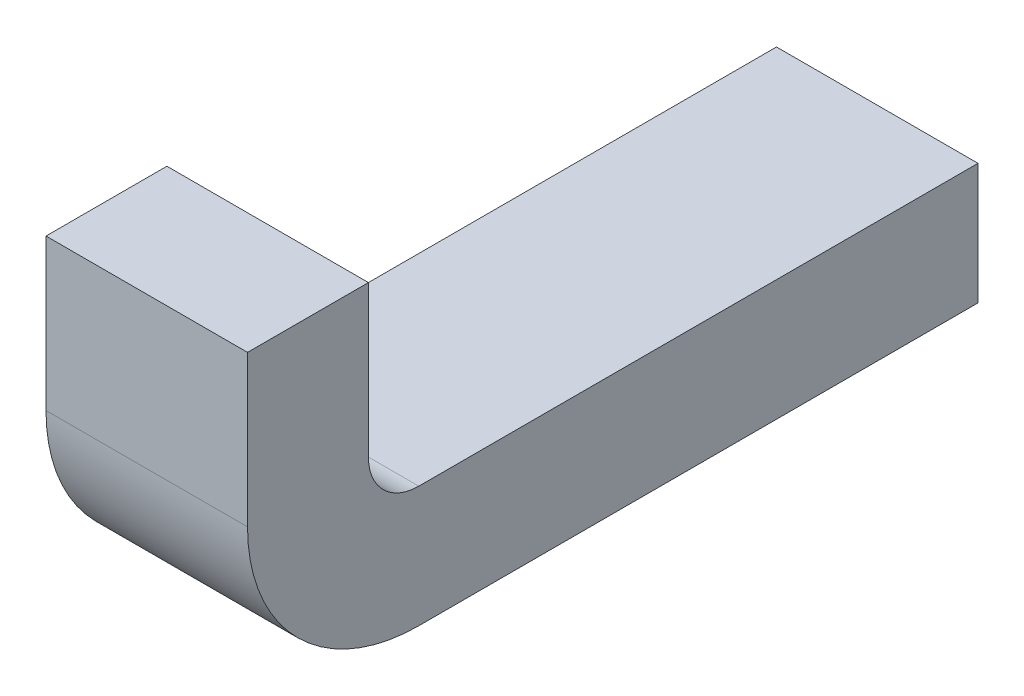
ISO-10303-21;
HEADER;
FILE_DESCRIPTION(('STEP AP214'),'2;1');
FILE_NAME('part.step','',(''),(''),'','','');
FILE_SCHEMA(('AUTOMOTIVE_DESIGN { 1 0 10303 214 1 1 1 1 }'));
ENDSEC;
DATA;
#1=APPLICATION_CONTEXT('core data for automotive mechanical design processes');
#2=APPLICATION_PROTOCOL_DEFINITION('international standard','automotive_design',2000,#1);
#3=PRODUCT_CONTEXT('',#1,'mechanical');
#4=PRODUCT('Part','Part','',(#3));
#5=PRODUCT_RELATED_PRODUCT_CATEGORY('part','',(#4));
#6=PRODUCT_DEFINITION_FORMATION('','',#4);
#7=PRODUCT_DEFINITION_CONTEXT('part definition',#1,'design');
#8=PRODUCT_DEFINITION('design','',#6,#7);
#9=PRODUCT_DEFINITION_SHAPE('','',#8);
#10=(LENGTH_UNIT() NAMED_UNIT(*) SI_UNIT(.MILLI.,.METRE.));
#11=(NAMED_UNIT(*) PLANE_ANGLE_UNIT() SI_UNIT($,.RADIAN.));
#12=(NAMED_UNIT(*) SI_UNIT($,.STERADIAN.) SOLID_ANGLE_UNIT());
#13=UNCERTAINTY_MEASURE_WITH_UNIT(LENGTH_MEASURE(1.E-05),#10,'distance_accuracy_value','');
#14=(GEOMETRIC_REPRESENTATION_CONTEXT(3) GLOBAL_UNCERTAINTY_ASSIGNED_CONTEXT((#13)) GLOBAL_UNIT_ASSIGNED_CONTEXT((#10,
#11,#12)) REPRESENTATION_CONTEXT('',''));
#15=CARTESIAN_POINT('',(0.,0.,0.));
#16=DIRECTION('',(0.,0.,1.));
#17=DIRECTION('',(1.,0.,0.));
#18=AXIS2_PLACEMENT_3D('',#15,#16,#17);
#19=CARTESIAN_POINT('',(0.15,0.,-3.300000000002));
#20=DIRECTION('',(0.,-1.,0.));
#21=DIRECTION('',(1.,0.,0.));
#22=AXIS2_PLACEMENT_3D('',#19,#20,#21);
#23=PLANE('',#22);
#24=DIRECTION('',(0.,0.,1.));
#25=VECTOR('',#24,1.);
#26=CARTESIAN_POINT('',(0.15,0.,-3.300000000002));
#27=LINE('',#26,#25);
#28=CARTESIAN_POINT('',(0.15,0.,-3.300000000002));
#29=VERTEX_POINT('',#28);
#30=CARTESIAN_POINT('',(0.15,0.,-3.854999999999));
#31=VERTEX_POINT('',#30);
#32=EDGE_CURVE('E121',#29,#31,#27,.F.);
#33=ORIENTED_EDGE('',*,*,#32,.T.);
#34=DIRECTION('',(-1.,0.,0.));
#35=VECTOR('',#34,1.);
#36=CARTESIAN_POINT('',(0.15,0.,-3.854999999999));
#37=LINE('',#36,#35);
#38=CARTESIAN_POINT('',(0.35,0.,-3.854999999999));
#39=VERTEX_POINT('',#38);
#40=EDGE_CURVE('E124',#39,#31,#37,.T.);
#41=ORIENTED_EDGE('',*,*,#40,.F.);
#42=DIRECTION('',(0.,0.,1.));
#43=VECTOR('',#42,1.);
#44=CARTESIAN_POINT('',(0.35,0.,-3.300000000002));
#45=LINE('',#44,#43);
#46=CARTESIAN_POINT('',(0.35,0.,-3.300000000002));
#47=VERTEX_POINT('',#46);
#48=EDGE_CURVE('E154',#47,#39,#45,.F.);
#49=ORIENTED_EDGE('',*,*,#48,.F.);
#50=DIRECTION('',(1.,0.,0.));
#51=VECTOR('',#50,1.);
#52=CARTESIAN_POINT('',(0.15,0.,-3.300000000002));
#53=LINE('',#52,#51);
#54=EDGE_CURVE('E63',#29,#47,#53,.T.);
#55=ORIENTED_EDGE('',*,*,#54,.F.);
#56=EDGE_LOOP('',(#33,#41,#49,#55));
#57=FACE_BOUND('',#56,.T.);
#58=ADVANCED_FACE('F16',(#57),#23,.T.);
#59=CARTESIAN_POINT('',(0.15,0.32,-3.250000000002));
#60=DIRECTION('',(0.,1.,1.246832498358E-13));
#61=DIRECTION('',(0.,-1.246832498358E-13,1.));
#62=AXIS2_PLACEMENT_3D('',#59,#60,#61);
#63=PLANE('',#62);
#64=DIRECTION('',(0.,0.,1.));
#65=VECTOR('',#64,1.);
#66=CARTESIAN_POINT('',(0.15,0.32,-3.300000000002));
#67=LINE('',#66,#65);
#68=CARTESIAN_POINT('',(0.15,0.32,-3.250000000002));
#69=VERTEX_POINT('',#68);
#70=CARTESIAN_POINT('',(0.15,0.32,-3.130000000002));
#71=VERTEX_POINT('',#70);
#72=EDGE_CURVE('E100',#69,#71,#67,.T.);
#73=ORIENTED_EDGE('',*,*,#72,.T.);
#74=DIRECTION('',(1.,0.,0.));
#75=VECTOR('',#74,1.);
#76=CARTESIAN_POINT('',(0.15,0.32,-3.130000000002));
#77=LINE('',#76,#75);
#78=CARTESIAN_POINT('',(0.35,0.32,-3.130000000002));
#79=VERTEX_POINT('',#78);
#80=EDGE_CURVE('E162',#79,#71,#77,.F.);
#81=ORIENTED_EDGE('',*,*,#80,.F.);
#82=DIRECTION('',(0.,0.,1.));
#83=VECTOR('',#82,1.);
#84=CARTESIAN_POINT('',(0.35,0.32,-3.300000000002));
#85=LINE('',#84,#83);
#86=CARTESIAN_POINT('',(0.35,0.32,-3.250000000002));
#87=VERTEX_POINT('',#86);
#88=EDGE_CURVE('E150',#87,#79,#85,.T.);
#89=ORIENTED_EDGE('',*,*,#88,.F.);
#90=DIRECTION('',(-1.,0.,0.));
#91=VECTOR('',#90,1.);
#92=CARTESIAN_POINT('',(0.15,0.32,-3.250000000002));
#93=LINE('',#92,#91);
#94=EDGE_CURVE('E72',#69,#87,#93,.F.);
#95=ORIENTED_EDGE('',*,*,#94,.F.);
#96=EDGE_LOOP('',(#73,#81,#89,#95));
#97=FACE_BOUND('',#96,.T.);
#98=ADVANCED_FACE('F182',(#97),#63,.T.);
#99=CARTESIAN_POINT('',(0.15,0.32,-3.130000000002));
#100=DIRECTION('',(0.,0.,1.));
#101=DIRECTION('',(1.,0.,0.));
#102=AXIS2_PLACEMENT_3D('',#99,#100,#101);
#103=PLANE('',#102);
#104=DIRECTION('',(0.,1.,0.));
#105=VECTOR('',#104,1.);
#106=CARTESIAN_POINT('',(0.15,0.17,-3.130000000002));
#107=LINE('',#106,#105);
#108=CARTESIAN_POINT('',(0.15,0.17,-3.130000000002));
#109=VERTEX_POINT('',#108);
#110=EDGE_CURVE('E110',#71,#109,#107,.F.);
#111=ORIENTED_EDGE('',*,*,#110,.T.);
#112=DIRECTION('',(1.,0.,0.));
#113=VECTOR('',#112,1.);
#114=CARTESIAN_POINT('',(0.15,0.17,-3.130000000002));
#115=LINE('',#114,#113);
#116=CARTESIAN_POINT('',(0.35,0.17,-3.130000000002));
#117=VERTEX_POINT('',#116);
#118=EDGE_CURVE('E57',#117,#109,#115,.F.);
#119=ORIENTED_EDGE('',*,*,#118,.F.);
#120=DIRECTION('',(0.,1.,0.));
#121=VECTOR('',#120,1.);
#122=CARTESIAN_POINT('',(0.35,0.17,-3.130000000002));
#123=LINE('',#122,#121);
#124=EDGE_CURVE('E141',#79,#117,#123,.F.);
#125=ORIENTED_EDGE('',*,*,#124,.F.);
#126=ORIENTED_EDGE('',*,*,#80,.T.);
#127=EDGE_LOOP('',(#111,#119,#125,#126));
#128=FACE_BOUND('',#127,.T.);
#129=ADVANCED_FACE('F183',(#128),#103,.T.);
#130=CARTESIAN_POINT('',(0.15,0.17,-3.300000000002));
#131=DIRECTION('',(1.,0.,0.));
#132=DIRECTION('',(0.,1.,0.));
#133=AXIS2_PLACEMENT_3D('',#130,#131,#132);
#134=CYLINDRICAL_SURFACE('',#133,0.17);
#135=CARTESIAN_POINT('',(0.15,0.17,-3.300000000002));
#136=DIRECTION('',(1.,0.,0.));
#137=DIRECTION('',(0.,1.,0.));
#138=AXIS2_PLACEMENT_3D('',#135,#136,#137);
#139=CIRCLE('',#138,0.17);
#140=EDGE_CURVE('E96',#109,#29,#139,.T.);
#141=ORIENTED_EDGE('',*,*,#140,.T.);
#142=ORIENTED_EDGE('',*,*,#54,.T.);
#143=CARTESIAN_POINT('',(0.35,0.17,-3.300000000002));
#144=DIRECTION('',(1.,0.,0.));
#145=DIRECTION('',(0.,1.,0.));
#146=AXIS2_PLACEMENT_3D('',#143,#144,#145);
#147=CIRCLE('',#146,0.17);
#148=EDGE_CURVE('E19',#117,#47,#147,.T.);
#149=ORIENTED_EDGE('',*,*,#148,.F.);
#150=ORIENTED_EDGE('',*,*,#118,.T.);
#151=EDGE_LOOP('',(#141,#142,#149,#150));
#152=FACE_BOUND('',#151,.T.);
#153=ADVANCED_FACE('F185',(#152),#134,.T.);
#154=CARTESIAN_POINT('',(0.15,0.17,-3.250000000002));
#155=DIRECTION('',(0.,0.,-1.));
#156=DIRECTION('',(-1.,0.,0.));
#157=AXIS2_PLACEMENT_3D('',#154,#155,#156);
#158=PLANE('',#157);
#159=DIRECTION('',(0.,1.,0.));
#160=VECTOR('',#159,1.);
#161=CARTESIAN_POINT('',(0.15,0.17,-3.250000000002));
#162=LINE('',#161,#160);
#163=CARTESIAN_POINT('',(0.15,0.17,-3.250000000002));
#164=VERTEX_POINT('',#163);
#165=EDGE_CURVE('E92',#164,#69,#162,.T.);
#166=ORIENTED_EDGE('',*,*,#165,.T.);
#167=ORIENTED_EDGE('',*,*,#94,.T.);
#168=DIRECTION('',(0.,1.,0.));
#169=VECTOR('',#168,1.);
#170=CARTESIAN_POINT('',(0.35,0.17,-3.250000000002));
#171=LINE('',#170,#169);
#172=CARTESIAN_POINT('',(0.35,0.17,-3.250000000002));
#173=VERTEX_POINT('',#172);
#174=EDGE_CURVE('E87',#173,#87,#171,.T.);
#175=ORIENTED_EDGE('',*,*,#174,.F.);
#176=DIRECTION('',(1.,0.,0.));
#177=VECTOR('',#176,1.);
#178=CARTESIAN_POINT('',(0.15,0.17,-3.250000000002));
#179=LINE('',#178,#177);
#180=EDGE_CURVE('E90',#173,#164,#179,.F.);
#181=ORIENTED_EDGE('',*,*,#180,.T.);
#182=EDGE_LOOP('',(#166,#167,#175,#181));
#183=FACE_BOUND('',#182,.T.);
#184=ADVANCED_FACE('F91',(#183),#158,.T.);
#185=CARTESIAN_POINT('',(0.35,0.17,-3.300000000002));
#186=DIRECTION('',(1.,0.,0.));
#187=DIRECTION('',(0.,1.,0.));
#188=AXIS2_PLACEMENT_3D('',#185,#186,#187);
#189=PLANE('',#188);
#190=ORIENTED_EDGE('',*,*,#88,.T.);
#191=ORIENTED_EDGE('',*,*,#124,.T.);
#192=ORIENTED_EDGE('',*,*,#148,.T.);
#193=ORIENTED_EDGE('',*,*,#48,.T.);
#194=DIRECTION('',(0.,1.,0.));
#195=VECTOR('',#194,1.);
#196=CARTESIAN_POINT('',(0.35,0.,-3.854999999999));
#197=LINE('',#196,#195);
#198=CARTESIAN_POINT('',(0.35,0.12,-3.854999999999));
#199=VERTEX_POINT('',#198);
#200=EDGE_CURVE('E138',#199,#39,#197,.F.);
#201=ORIENTED_EDGE('',*,*,#200,.F.);
#202=DIRECTION('',(0.,0.,1.));
#203=VECTOR('',#202,1.);
#204=CARTESIAN_POINT('',(0.35,0.12,-3.854999999999));
#205=LINE('',#204,#203);
#206=CARTESIAN_POINT('',(0.35,0.119999999999999,-3.300000000002));
#207=VERTEX_POINT('',#206);
#208=EDGE_CURVE('E107',#207,#199,#205,.F.);
#209=ORIENTED_EDGE('',*,*,#208,.F.);
#210=CARTESIAN_POINT('',(0.35,0.17,-3.300000000002));
#211=DIRECTION('',(1.,0.,0.));
#212=DIRECTION('',(0.,1.,0.));
#213=AXIS2_PLACEMENT_3D('',#210,#211,#212);
#214=CIRCLE('',#213,0.05);
#215=EDGE_CURVE('E105',#207,#173,#214,.F.);
#216=ORIENTED_EDGE('',*,*,#215,.T.);
#217=ORIENTED_EDGE('',*,*,#174,.T.);
#218=EDGE_LOOP('',(#190,#191,#192,#193,#201,#209,#216,#217));
#219=FACE_BOUND('',#218,.T.);
#220=ADVANCED_FACE('F179',(#219),#189,.T.);
#221=CARTESIAN_POINT('',(0.15,0.,-3.854999999999));
#222=DIRECTION('',(0.,0.,-1.));
#223=DIRECTION('',(-1.,0.,0.));
#224=AXIS2_PLACEMENT_3D('',#221,#222,#223);
#225=PLANE('',#224);
#226=DIRECTION('',(0.,1.,0.));
#227=VECTOR('',#226,1.);
#228=CARTESIAN_POINT('',(0.15,0.17,-3.854999999999));
#229=LINE('',#228,#227);
#230=CARTESIAN_POINT('',(0.15,0.12,-3.854999999999));
#231=VERTEX_POINT('',#230);
#232=EDGE_CURVE('E101',#31,#231,#229,.T.);
#233=ORIENTED_EDGE('',*,*,#232,.T.);
#234=DIRECTION('',(-1.,0.,0.));
#235=VECTOR('',#234,1.);
#236=CARTESIAN_POINT('',(0.15,0.12,-3.854999999999));
#237=LINE('',#236,#235);
#238=EDGE_CURVE('E128',#199,#231,#237,.T.);
#239=ORIENTED_EDGE('',*,*,#238,.F.);
#240=ORIENTED_EDGE('',*,*,#200,.T.);
#241=ORIENTED_EDGE('',*,*,#40,.T.);
#242=EDGE_LOOP('',(#233,#239,#240,#241));
#243=FACE_BOUND('',#242,.T.);
#244=ADVANCED_FACE('F204',(#243),#225,.T.);
#245=CARTESIAN_POINT('',(0.15,0.17,-3.300000000002));
#246=DIRECTION('',(1.,0.,0.));
#247=DIRECTION('',(0.,1.,0.));
#248=AXIS2_PLACEMENT_3D('',#245,#246,#247);
#249=PLANE('',#248);
#250=ORIENTED_EDGE('',*,*,#110,.F.);
#251=ORIENTED_EDGE('',*,*,#72,.F.);
#252=ORIENTED_EDGE('',*,*,#165,.F.);
#253=CARTESIAN_POINT('',(0.15,0.17,-3.300000000002));
#254=DIRECTION('',(1.,0.,0.));
#255=DIRECTION('',(0.,1.,0.));
#256=AXIS2_PLACEMENT_3D('',#253,#254,#255);
#257=CIRCLE('',#256,0.05);
#258=CARTESIAN_POINT('',(0.15,0.12,-3.300000000002));
#259=VERTEX_POINT('',#258);
#260=EDGE_CURVE('E34',#164,#259,#257,.T.);
#261=ORIENTED_EDGE('',*,*,#260,.T.);
#262=DIRECTION('',(0.,0.,1.));
#263=VECTOR('',#262,1.);
#264=CARTESIAN_POINT('',(0.15,0.12,-3.854999999999));
#265=LINE('',#264,#263);
#266=EDGE_CURVE('E25',#231,#259,#265,.T.);
#267=ORIENTED_EDGE('',*,*,#266,.F.);
#268=ORIENTED_EDGE('',*,*,#232,.F.);
#269=ORIENTED_EDGE('',*,*,#32,.F.);
#270=ORIENTED_EDGE('',*,*,#140,.F.);
#271=EDGE_LOOP('',(#250,#251,#252,#261,#267,#268,#269,#270));
#272=FACE_BOUND('',#271,.T.);
#273=ADVANCED_FACE('F99',(#272),#249,.F.);
#274=CARTESIAN_POINT('',(0.15,0.17,-3.300000000002));
#275=DIRECTION('',(1.,0.,0.));
#276=DIRECTION('',(0.,1.,0.));
#277=AXIS2_PLACEMENT_3D('',#274,#275,#276);
#278=CYLINDRICAL_SURFACE('',#277,0.05);
#279=DIRECTION('',(-1.,0.,0.));
#280=VECTOR('',#279,1.);
#281=CARTESIAN_POINT('',(0.15,0.12,-3.300000000002));
#282=LINE('',#281,#280);
#283=EDGE_CURVE('E11',#259,#207,#282,.F.);
#284=ORIENTED_EDGE('',*,*,#283,.F.);
#285=ORIENTED_EDGE('',*,*,#260,.F.);
#286=ORIENTED_EDGE('',*,*,#180,.F.);
#287=ORIENTED_EDGE('',*,*,#215,.F.);
#288=EDGE_LOOP('',(#284,#285,#286,#287));
#289=FACE_BOUND('',#288,.T.);
#290=ADVANCED_FACE('F103',(#289),#278,.F.);
#291=CARTESIAN_POINT('',(0.15,0.12,-3.854999999999));
#292=DIRECTION('',(0.,1.,0.));
#293=DIRECTION('',(-1.,0.,0.));
#294=AXIS2_PLACEMENT_3D('',#291,#292,#293);
#295=PLANE('',#294);
#296=ORIENTED_EDGE('',*,*,#266,.T.);
#297=ORIENTED_EDGE('',*,*,#283,.T.);
#298=ORIENTED_EDGE('',*,*,#208,.T.);
#299=ORIENTED_EDGE('',*,*,#238,.T.);
#300=EDGE_LOOP('',(#296,#297,#298,#299));
#301=FACE_BOUND('',#300,.T.);
#302=ADVANCED_FACE('F193',(#301),#295,.T.);
#303=CLOSED_SHELL('',(#58,#98,#129,#153,#184,#220,#244,#273,#290,#302));
#304=MANIFOLD_SOLID_BREP('B1',#303);
#305=ADVANCED_BREP_SHAPE_REPRESENTATION('',(#18,#304),#14);
#306=SHAPE_DEFINITION_REPRESENTATION(#9,#305);
ENDSEC;
END-ISO-10303-21;
